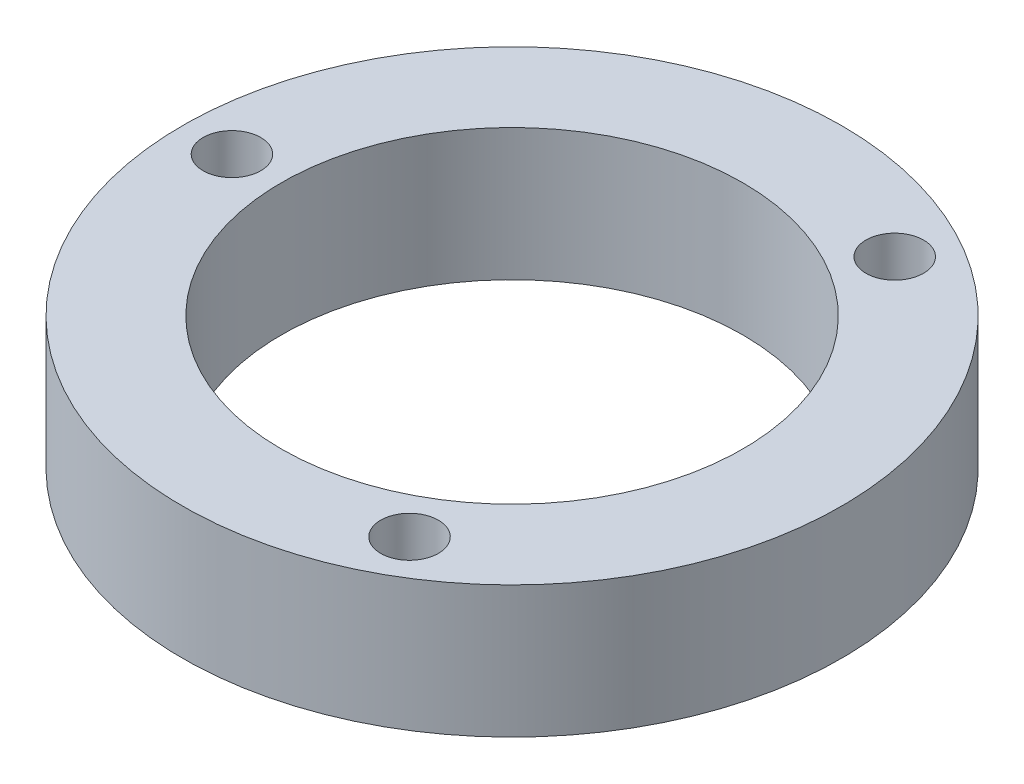
ISO-10303-21;
HEADER;
FILE_DESCRIPTION(('STEP AP214'),'2;1');
FILE_NAME('part.step','',(''),(''),'','','');
FILE_SCHEMA(('AUTOMOTIVE_DESIGN { 1 0 10303 214 1 1 1 1 }'));
ENDSEC;
DATA;
#1=APPLICATION_CONTEXT('core data for automotive mechanical design processes');
#2=APPLICATION_PROTOCOL_DEFINITION('international standard','automotive_design',2000,#1);
#3=PRODUCT_CONTEXT('',#1,'mechanical');
#4=PRODUCT('Part','Part','',(#3));
#5=PRODUCT_RELATED_PRODUCT_CATEGORY('part','',(#4));
#6=PRODUCT_DEFINITION_FORMATION('','',#4);
#7=PRODUCT_DEFINITION_CONTEXT('part definition',#1,'design');
#8=PRODUCT_DEFINITION('design','',#6,#7);
#9=PRODUCT_DEFINITION_SHAPE('','',#8);
#10=(LENGTH_UNIT() NAMED_UNIT(*) SI_UNIT(.MILLI.,.METRE.));
#11=(NAMED_UNIT(*) PLANE_ANGLE_UNIT() SI_UNIT($,.RADIAN.));
#12=(NAMED_UNIT(*) SI_UNIT($,.STERADIAN.) SOLID_ANGLE_UNIT());
#13=UNCERTAINTY_MEASURE_WITH_UNIT(LENGTH_MEASURE(1.E-05),#10,'distance_accuracy_value','');
#14=(GEOMETRIC_REPRESENTATION_CONTEXT(3) GLOBAL_UNCERTAINTY_ASSIGNED_CONTEXT((#13)) GLOBAL_UNIT_ASSIGNED_CONTEXT((#10,
#11,#12)) REPRESENTATION_CONTEXT('',''));
#15=CARTESIAN_POINT('',(0.,0.,0.));
#16=DIRECTION('',(0.,0.,1.));
#17=DIRECTION('',(1.,0.,0.));
#18=AXIS2_PLACEMENT_3D('',#15,#16,#17);
#19=CARTESIAN_POINT('',(-34.1432255553676,-8.,5.12970783045502));
#20=DIRECTION('',(0.,1.,0.));
#21=DIRECTION('',(0.,0.,1.));
#22=AXIS2_PLACEMENT_3D('',#19,#20,#21);
#23=CYLINDRICAL_SURFACE('',#22,20.);
#24=CARTESIAN_POINT('',(-34.1432255553676,-8.,5.12970783045502));
#25=DIRECTION('',(0.,-1.,0.));
#26=DIRECTION('',(0.,0.,-1.));
#27=AXIS2_PLACEMENT_3D('',#24,#25,#26);
#28=CIRCLE('',#27,20.);
#29=CARTESIAN_POINT('',(-34.1432255553676,-8.,-14.870292169545));
#30=VERTEX_POINT('',#29);
#31=EDGE_CURVE('E10',#30,#30,#28,.T.);
#32=ORIENTED_EDGE('',*,*,#31,.F.);
#33=EDGE_LOOP('',(#32));
#34=FACE_BOUND('',#33,.T.);
#35=CARTESIAN_POINT('',(-34.1432255553676,0.,5.12970783045502));
#36=DIRECTION('',(0.,-1.,0.));
#37=DIRECTION('',(0.,0.,-1.));
#38=AXIS2_PLACEMENT_3D('',#35,#36,#37);
#39=CIRCLE('',#38,20.);
#40=CARTESIAN_POINT('',(-34.1432255553676,0.,-14.870292169545));
#41=VERTEX_POINT('',#40);
#42=EDGE_CURVE('E34',#41,#41,#39,.T.);
#43=ORIENTED_EDGE('',*,*,#42,.T.);
#44=EDGE_LOOP('',(#43));
#45=FACE_BOUND('',#44,.T.);
#46=ADVANCED_FACE('F31',(#34,#45),#23,.T.);
#47=CARTESIAN_POINT('',(-34.1432255553676,-8.,5.12970783045502));
#48=DIRECTION('',(0.,-1.,0.));
#49=DIRECTION('',(0.,0.,-1.));
#50=AXIS2_PLACEMENT_3D('',#47,#48,#49);
#51=PLANE('',#50);
#52=CARTESIAN_POINT('',(-51.1432255553676,-8.,5.12970783045502));
#53=DIRECTION('',(0.,-1.,0.));
#54=DIRECTION('',(0.,0.,-1.));
#55=AXIS2_PLACEMENT_3D('',#52,#53,#54);
#56=CIRCLE('',#55,1.75);
#57=CARTESIAN_POINT('',(-51.1432255553676,-8.,3.37970783045502));
#58=VERTEX_POINT('',#57);
#59=EDGE_CURVE('E63',#58,#58,#56,.T.);
#60=ORIENTED_EDGE('',*,*,#59,.F.);
#61=EDGE_LOOP('',(#60));
#62=FACE_BOUND('',#61,.T.);
#63=CARTESIAN_POINT('',(-25.6432255553676,-8.,-9.59272403388045));
#64=DIRECTION('',(0.,-1.,0.));
#65=DIRECTION('',(0.,0.,-1.));
#66=AXIS2_PLACEMENT_3D('',#63,#64,#65);
#67=CIRCLE('',#66,1.75000000000001);
#68=CARTESIAN_POINT('',(-25.6432255553676,-8.,-11.3427240338805));
#69=VERTEX_POINT('',#68);
#70=EDGE_CURVE('E57',#69,#69,#67,.T.);
#71=ORIENTED_EDGE('',*,*,#70,.F.);
#72=EDGE_LOOP('',(#71));
#73=FACE_BOUND('',#72,.T.);
#74=CARTESIAN_POINT('',(-25.6432255553676,-8.,19.8521396947905));
#75=DIRECTION('',(0.,-1.,0.));
#76=DIRECTION('',(0.,0.,-1.));
#77=AXIS2_PLACEMENT_3D('',#74,#75,#76);
#78=CIRCLE('',#77,1.75);
#79=CARTESIAN_POINT('',(-25.6432255553676,-8.,18.1021396947905));
#80=VERTEX_POINT('',#79);
#81=EDGE_CURVE('E51',#80,#80,#78,.T.);
#82=ORIENTED_EDGE('',*,*,#81,.F.);
#83=EDGE_LOOP('',(#82));
#84=FACE_BOUND('',#83,.T.);
#85=CARTESIAN_POINT('',(-34.1432255553676,-8.,5.12970783045502));
#86=DIRECTION('',(0.,1.,0.));
#87=DIRECTION('',(0.,0.,1.));
#88=AXIS2_PLACEMENT_3D('',#85,#86,#87);
#89=CIRCLE('',#88,14.);
#90=CARTESIAN_POINT('',(-34.1432255553676,-8.,19.129707830455));
#91=VERTEX_POINT('',#90);
#92=EDGE_CURVE('E41',#91,#91,#89,.T.);
#93=ORIENTED_EDGE('',*,*,#92,.T.);
#94=EDGE_LOOP('',(#93));
#95=FACE_BOUND('',#94,.T.);
#96=ORIENTED_EDGE('',*,*,#31,.T.);
#97=EDGE_LOOP('',(#96));
#98=FACE_BOUND('',#97,.T.);
#99=ADVANCED_FACE('F70',(#62,#73,#84,#95,#98),#51,.T.);
#100=CARTESIAN_POINT('',(-34.1432255553676,0.,5.12970783045502));
#101=DIRECTION('',(0.,-1.,0.));
#102=DIRECTION('',(0.,0.,-1.));
#103=AXIS2_PLACEMENT_3D('',#100,#101,#102);
#104=PLANE('',#103);
#105=CARTESIAN_POINT('',(-51.1432255553676,0.,5.12970783045502));
#106=DIRECTION('',(0.,-1.,0.));
#107=DIRECTION('',(0.,0.,-1.));
#108=AXIS2_PLACEMENT_3D('',#105,#106,#107);
#109=CIRCLE('',#108,1.75);
#110=CARTESIAN_POINT('',(-51.1432255553676,0.,3.37970783045502));
#111=VERTEX_POINT('',#110);
#112=EDGE_CURVE('E60',#111,#111,#109,.F.);
#113=ORIENTED_EDGE('',*,*,#112,.F.);
#114=EDGE_LOOP('',(#113));
#115=FACE_BOUND('',#114,.T.);
#116=CARTESIAN_POINT('',(-25.6432255553676,0.,-9.59272403388045));
#117=DIRECTION('',(0.,-1.,0.));
#118=DIRECTION('',(0.,0.,-1.));
#119=AXIS2_PLACEMENT_3D('',#116,#117,#118);
#120=CIRCLE('',#119,1.75000000000001);
#121=CARTESIAN_POINT('',(-25.6432255553676,0.,-11.3427240338805));
#122=VERTEX_POINT('',#121);
#123=EDGE_CURVE('E54',#122,#122,#120,.F.);
#124=ORIENTED_EDGE('',*,*,#123,.F.);
#125=EDGE_LOOP('',(#124));
#126=FACE_BOUND('',#125,.T.);
#127=CARTESIAN_POINT('',(-25.6432255553676,0.,19.8521396947905));
#128=DIRECTION('',(0.,-1.,0.));
#129=DIRECTION('',(0.,0.,-1.));
#130=AXIS2_PLACEMENT_3D('',#127,#128,#129);
#131=CIRCLE('',#130,1.75);
#132=CARTESIAN_POINT('',(-25.6432255553676,0.,18.1021396947905));
#133=VERTEX_POINT('',#132);
#134=EDGE_CURVE('E46',#133,#133,#131,.F.);
#135=ORIENTED_EDGE('',*,*,#134,.F.);
#136=EDGE_LOOP('',(#135));
#137=FACE_BOUND('',#136,.T.);
#138=CARTESIAN_POINT('',(-34.1432255553676,0.,5.12970783045502));
#139=DIRECTION('',(0.,1.,0.));
#140=DIRECTION('',(0.,0.,1.));
#141=AXIS2_PLACEMENT_3D('',#138,#139,#140);
#142=CIRCLE('',#141,14.);
#143=CARTESIAN_POINT('',(-34.1432255553676,0.,19.129707830455));
#144=VERTEX_POINT('',#143);
#145=EDGE_CURVE('E43',#144,#144,#142,.T.);
#146=ORIENTED_EDGE('',*,*,#145,.F.);
#147=EDGE_LOOP('',(#146));
#148=FACE_BOUND('',#147,.T.);
#149=ORIENTED_EDGE('',*,*,#42,.F.);
#150=EDGE_LOOP('',(#149));
#151=FACE_BOUND('',#150,.T.);
#152=ADVANCED_FACE('F73',(#115,#126,#137,#148,#151),#104,.F.);
#153=CARTESIAN_POINT('',(-34.1432255553676,-8.,5.12970783045502));
#154=DIRECTION('',(0.,1.,0.));
#155=DIRECTION('',(0.,0.,1.));
#156=AXIS2_PLACEMENT_3D('',#153,#154,#155);
#157=CYLINDRICAL_SURFACE('',#156,14.);
#158=ORIENTED_EDGE('',*,*,#92,.F.);
#159=EDGE_LOOP('',(#158));
#160=FACE_BOUND('',#159,.T.);
#161=ORIENTED_EDGE('',*,*,#145,.T.);
#162=EDGE_LOOP('',(#161));
#163=FACE_BOUND('',#162,.T.);
#164=ADVANCED_FACE('F81',(#160,#163),#157,.F.);
#165=CARTESIAN_POINT('',(-25.6432255553676,0.000999999999999265,19.8521396947905));
#166=DIRECTION('',(0.,-1.,0.));
#167=DIRECTION('',(0.,0.,-1.));
#168=AXIS2_PLACEMENT_3D('',#165,#166,#167);
#169=CYLINDRICAL_SURFACE('',#168,1.75);
#170=ORIENTED_EDGE('',*,*,#81,.T.);
#171=EDGE_LOOP('',(#170));
#172=FACE_BOUND('',#171,.T.);
#173=ORIENTED_EDGE('',*,*,#134,.T.);
#174=EDGE_LOOP('',(#173));
#175=FACE_BOUND('',#174,.T.);
#176=ADVANCED_FACE('F84',(#172,#175),#169,.F.);
#177=CARTESIAN_POINT('',(-25.6432255553676,0.000999999999999265,-9.59272403388045));
#178=DIRECTION('',(0.,-1.,0.));
#179=DIRECTION('',(0.,0.,-1.));
#180=AXIS2_PLACEMENT_3D('',#177,#178,#179);
#181=CYLINDRICAL_SURFACE('',#180,1.75000000000001);
#182=ORIENTED_EDGE('',*,*,#70,.T.);
#183=EDGE_LOOP('',(#182));
#184=FACE_BOUND('',#183,.T.);
#185=ORIENTED_EDGE('',*,*,#123,.T.);
#186=EDGE_LOOP('',(#185));
#187=FACE_BOUND('',#186,.T.);
#188=ADVANCED_FACE('F119',(#184,#187),#181,.F.);
#189=CARTESIAN_POINT('',(-51.1432255553676,0.000999999999999265,5.12970783045502));
#190=DIRECTION('',(0.,-1.,0.));
#191=DIRECTION('',(0.,0.,-1.));
#192=AXIS2_PLACEMENT_3D('',#189,#190,#191);
#193=CYLINDRICAL_SURFACE('',#192,1.75);
#194=ORIENTED_EDGE('',*,*,#59,.T.);
#195=EDGE_LOOP('',(#194));
#196=FACE_BOUND('',#195,.T.);
#197=ORIENTED_EDGE('',*,*,#112,.T.);
#198=EDGE_LOOP('',(#197));
#199=FACE_BOUND('',#198,.T.);
#200=ADVANCED_FACE('F67',(#196,#199),#193,.F.);
#201=CLOSED_SHELL('',(#46,#99,#152,#164,#176,#188,#200));
#202=MANIFOLD_SOLID_BREP('B2',#201);
#203=ADVANCED_BREP_SHAPE_REPRESENTATION('',(#18,#202),#14);
#204=SHAPE_DEFINITION_REPRESENTATION(#9,#203);
ENDSEC;
END-ISO-10303-21;
